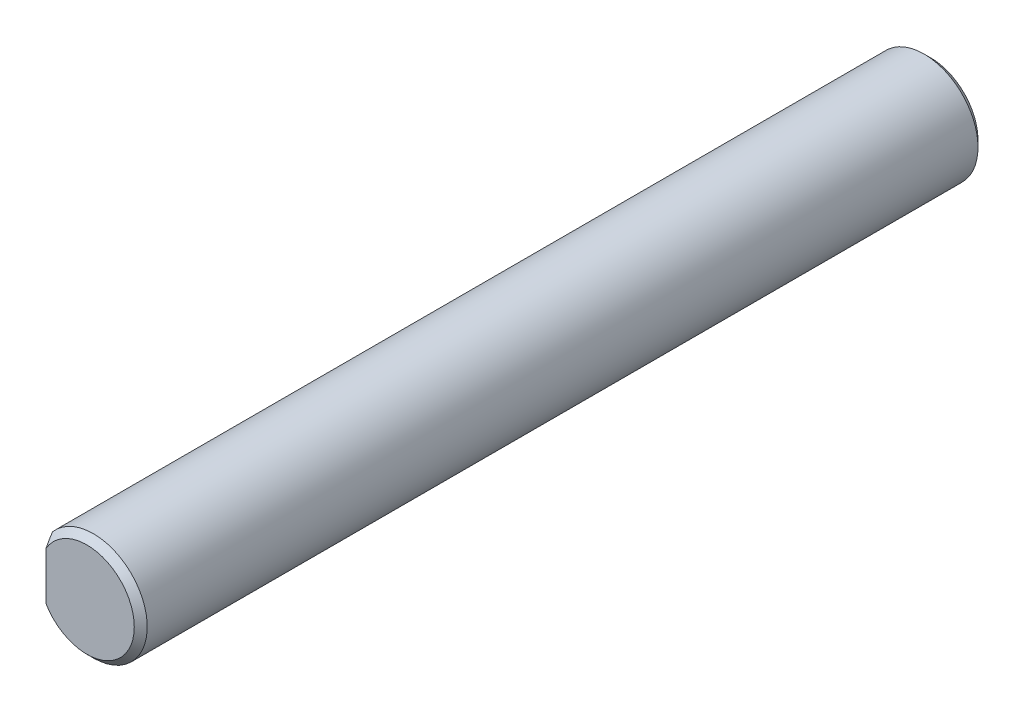
ISO-10303-21;
HEADER;
FILE_DESCRIPTION(('STEP AP214'),'2;1');
FILE_NAME('part.step','',(''),(''),'','','');
FILE_SCHEMA(('AUTOMOTIVE_DESIGN { 1 0 10303 214 1 1 1 1 }'));
ENDSEC;
DATA;
#1=APPLICATION_CONTEXT('core data for automotive mechanical design processes');
#2=APPLICATION_PROTOCOL_DEFINITION('international standard','automotive_design',2000,#1);
#3=PRODUCT_CONTEXT('',#1,'mechanical');
#4=PRODUCT('Part','Part','',(#3));
#5=PRODUCT_RELATED_PRODUCT_CATEGORY('part','',(#4));
#6=PRODUCT_DEFINITION_FORMATION('','',#4);
#7=PRODUCT_DEFINITION_CONTEXT('part definition',#1,'design');
#8=PRODUCT_DEFINITION('design','',#6,#7);
#9=PRODUCT_DEFINITION_SHAPE('','',#8);
#10=(LENGTH_UNIT() NAMED_UNIT(*) SI_UNIT(.MILLI.,.METRE.));
#11=(NAMED_UNIT(*) PLANE_ANGLE_UNIT() SI_UNIT($,.RADIAN.));
#12=(NAMED_UNIT(*) SI_UNIT($,.STERADIAN.) SOLID_ANGLE_UNIT());
#13=UNCERTAINTY_MEASURE_WITH_UNIT(LENGTH_MEASURE(1.E-05),#10,'distance_accuracy_value','');
#14=(GEOMETRIC_REPRESENTATION_CONTEXT(3) GLOBAL_UNCERTAINTY_ASSIGNED_CONTEXT((#13)) GLOBAL_UNIT_ASSIGNED_CONTEXT((#10,
#11,#12)) REPRESENTATION_CONTEXT('',''));
#15=CARTESIAN_POINT('',(0.,0.,0.));
#16=DIRECTION('',(0.,0.,1.));
#17=DIRECTION('',(1.,0.,0.));
#18=AXIS2_PLACEMENT_3D('',#15,#16,#17);
#19=CARTESIAN_POINT('',(0.,0.,65.));
#20=DIRECTION('',(0.,0.,-1.));
#21=DIRECTION('',(-1.,0.,0.));
#22=AXIS2_PLACEMENT_3D('',#19,#20,#21);
#23=CYLINDRICAL_SURFACE('',#22,4.15);
#24=CARTESIAN_POINT('',(0.,0.,64.5));
#25=DIRECTION('',(0.,0.,1.));
#26=DIRECTION('',(1.,0.,0.));
#27=AXIS2_PLACEMENT_3D('',#24,#25,#26);
#28=CIRCLE('',#27,4.15);
#29=CARTESIAN_POINT('',(-3.15,2.70185121722126,64.5));
#30=VERTEX_POINT('',#29);
#31=CARTESIAN_POINT('',(-3.15,-2.70185121722126,64.5));
#32=VERTEX_POINT('',#31);
#33=EDGE_CURVE('E92',#30,#32,#28,.F.);
#34=ORIENTED_EDGE('',*,*,#33,.T.);
#35=DIRECTION('',(0.,0.,-1.));
#36=VECTOR('',#35,1.);
#37=CARTESIAN_POINT('',(-3.15,-2.70185121722126,65.));
#38=LINE('',#37,#36);
#39=CARTESIAN_POINT('',(-3.15,-2.70185121722126,0.5));
#40=VERTEX_POINT('',#39);
#41=EDGE_CURVE('E101',#32,#40,#38,.T.);
#42=ORIENTED_EDGE('',*,*,#41,.T.);
#43=CARTESIAN_POINT('',(0.,0.,0.5));
#44=DIRECTION('',(0.,0.,1.));
#45=DIRECTION('',(1.,0.,0.));
#46=AXIS2_PLACEMENT_3D('',#43,#44,#45);
#47=CIRCLE('',#46,4.15);
#48=CARTESIAN_POINT('',(-3.15,2.70185121722126,0.5));
#49=VERTEX_POINT('',#48);
#50=EDGE_CURVE('E94',#40,#49,#47,.T.);
#51=ORIENTED_EDGE('',*,*,#50,.T.);
#52=DIRECTION('',(0.,0.,-1.));
#53=VECTOR('',#52,1.);
#54=CARTESIAN_POINT('',(-3.15,2.70185121722126,65.));
#55=LINE('',#54,#53);
#56=EDGE_CURVE('E82',#49,#30,#55,.F.);
#57=ORIENTED_EDGE('',*,*,#56,.T.);
#58=EDGE_LOOP('',(#34,#42,#51,#57));
#59=FACE_BOUND('',#58,.T.);
#60=ADVANCED_FACE('F37',(#59),#23,.T.);
#61=CARTESIAN_POINT('',(0.,0.,65.));
#62=DIRECTION('',(0.,0.,1.));
#63=DIRECTION('',(1.,0.,0.));
#64=AXIS2_PLACEMENT_3D('',#61,#62,#63);
#65=PLANE('',#64);
#66=DIRECTION('',(0.,1.,0.));
#67=VECTOR('',#66,1.);
#68=CARTESIAN_POINT('',(-3.15,0.,65.));
#69=LINE('',#68,#67);
#70=CARTESIAN_POINT('',(-3.15,-1.84390889145859,65.));
#71=VERTEX_POINT('',#70);
#72=CARTESIAN_POINT('',(-3.15,1.84390889145859,65.));
#73=VERTEX_POINT('',#72);
#74=EDGE_CURVE('E58',#71,#73,#69,.T.);
#75=ORIENTED_EDGE('',*,*,#74,.F.);
#76=CARTESIAN_POINT('',(0.,0.,65.));
#77=DIRECTION('',(0.,0.,1.));
#78=DIRECTION('',(1.,0.,0.));
#79=AXIS2_PLACEMENT_3D('',#76,#77,#78);
#80=CIRCLE('',#79,3.65000000000001);
#81=EDGE_CURVE('E88',#71,#73,#80,.T.);
#82=ORIENTED_EDGE('',*,*,#81,.T.);
#83=EDGE_LOOP('',(#75,#82));
#84=FACE_BOUND('',#83,.T.);
#85=ADVANCED_FACE('F108',(#84),#65,.T.);
#86=CARTESIAN_POINT('',(0.,0.,0.));
#87=DIRECTION('',(0.,0.,1.));
#88=DIRECTION('',(1.,0.,0.));
#89=AXIS2_PLACEMENT_3D('',#86,#87,#88);
#90=PLANE('',#89);
#91=CARTESIAN_POINT('',(0.,0.,0.));
#92=DIRECTION('',(0.,0.,1.));
#93=DIRECTION('',(1.,0.,0.));
#94=AXIS2_PLACEMENT_3D('',#91,#92,#93);
#95=CIRCLE('',#94,3.65);
#96=CARTESIAN_POINT('',(-3.15,1.84390889145858,0.));
#97=VERTEX_POINT('',#96);
#98=CARTESIAN_POINT('',(-3.15,-1.84390889145858,0.));
#99=VERTEX_POINT('',#98);
#100=EDGE_CURVE('E99',#97,#99,#95,.F.);
#101=ORIENTED_EDGE('',*,*,#100,.T.);
#102=DIRECTION('',(0.,1.,0.));
#103=VECTOR('',#102,1.);
#104=CARTESIAN_POINT('',(-3.15,0.,0.));
#105=LINE('',#104,#103);
#106=EDGE_CURVE('E114',#99,#97,#105,.T.);
#107=ORIENTED_EDGE('',*,*,#106,.T.);
#108=EDGE_LOOP('',(#101,#107));
#109=FACE_BOUND('',#108,.T.);
#110=ADVANCED_FACE('F125',(#109),#90,.F.);
#111=CARTESIAN_POINT('',(0.,0.,0.5));
#112=DIRECTION('',(0.,0.,1.));
#113=DIRECTION('',(1.,0.,0.));
#114=AXIS2_PLACEMENT_3D('',#111,#112,#113);
#115=CONICAL_SURFACE('',#114,4.15,0.785398163397447);
#116=CARTESIAN_POINT('',(-3.15,2.7029262827536,0.500700000000025));
#117=CARTESIAN_POINT('',(-3.15,2.637629899807,0.458184375078678));
#118=CARTESIAN_POINT('',(-3.15,2.57193326148151,0.416284388262859));
#119=CARTESIAN_POINT('',(-3.15,2.43962651077146,0.333916313916338));
#120=CARTESIAN_POINT('',(-3.15,2.37301617336793,0.29344858822739));
#121=CARTESIAN_POINT('',(-3.15,2.17105563797646,0.174149128258098));
#122=CARTESIAN_POINT('',(-3.15,2.03419581282266,0.0978300599651566));
#123=CARTESIAN_POINT('',(-3.15,1.75198989868226,-0.0476469780505971));
#124=CARTESIAN_POINT('',(-3.15,1.60651457541972,-0.116557220023333));
#125=CARTESIAN_POINT('',(-3.15,1.31013625517199,-0.241047530711626));
#126=CARTESIAN_POINT('',(-3.15,1.15924472299722,-0.296654043996579));
#127=CARTESIAN_POINT('',(-3.15,0.912569641399158,-0.371673187384497));
#128=CARTESIAN_POINT('',(-3.15,0.818498691645566,-0.396713913770698));
#129=CARTESIAN_POINT('',(-3.15,0.628627521630974,-0.43921815059806));
#130=CARTESIAN_POINT('',(-3.15,0.532827259030031,-0.45668147525373));
#131=CARTESIAN_POINT('',(-3.15,0.341148384622092,-0.482985820588795));
#132=CARTESIAN_POINT('',(-3.15,0.245283147879756,-0.491922981085286));
#133=CARTESIAN_POINT('',(-3.15,0.0531360260590637,-0.501013201032776));
#134=CARTESIAN_POINT('',(-3.15,-0.0431458299271616,-0.501166864234979));
#135=CARTESIAN_POINT('',(-3.15,-0.235354750454422,-0.492680380767895));
#136=CARTESIAN_POINT('',(-3.15,-0.33128165034413,-0.484036567842685));
#137=CARTESIAN_POINT('',(-3.15,-0.522013041428308,-0.458439399235446));
#138=CARTESIAN_POINT('',(-3.15,-0.616817404154601,-0.441485101700384));
#139=CARTESIAN_POINT('',(-3.15,-0.805812939144923,-0.399886881205596));
#140=CARTESIAN_POINT('',(-3.15,-0.899985422854078,-0.375159152178022));
#141=CARTESIAN_POINT('',(-3.15,-1.08632599779303,-0.319128693978767));
#142=CARTESIAN_POINT('',(-3.15,-1.17849408684547,-0.287825957665118));
#143=CARTESIAN_POINT('',(-3.15,-1.39793109253278,-0.205796928834585));
#144=CARTESIAN_POINT('',(-3.15,-1.52418124018571,-0.152356182736309));
#145=CARTESIAN_POINT('',(-3.15,-1.77284373915982,-0.0370620082297331));
#146=CARTESIAN_POINT('',(-3.15,-1.89525251939717,0.0247989785893932));
#147=CARTESIAN_POINT('',(-3.15,-2.13354971021547,0.153251610695179));
#148=CARTESIAN_POINT('',(-3.15,-2.24952473951393,0.219683828197564));
#149=CARTESIAN_POINT('',(-3.15,-2.42122613948456,0.322751459823801));
#150=CARTESIAN_POINT('',(-3.15,-2.47801776157065,0.357634291878479));
#151=CARTESIAN_POINT('',(-3.15,-2.59094623976219,0.428427545954595));
#152=CARTESIAN_POINT('',(-3.15,-2.6470831870412,0.464337822423802));
#153=CARTESIAN_POINT('',(-3.15,-2.7029262827536,0.500700000000026));
#154=B_SPLINE_CURVE_WITH_KNOTS('',3,(#116,#117,#118,#119,#120,#121,#122,#123,#124,#125,#126,
#127,#128,#129,#130,#131,#132,#133,#134,#135,#136,#137,#138,#139,#140,#141,#142,#143,#144,#145,
#146,#147,#148,#149,#150,#151,#152,#153),.UNSPECIFIED.,.F.,.F.,(4,2,2,2,2,2,2,2,2,2,2,2,2,2,2,2,
2,2,4),(0.,0.233746454261257,0.467551545949215,0.937387559992727,1.41985669791922,
1.90135868506937,2.19313872315265,2.48492591480079,2.7733826491856,3.06181955589766,
3.35037671490418,3.63896658455378,3.93078112099976,4.222595974425,4.63345118845378,
5.04467766830278,5.44549250636035,5.6454312442884,5.84534179691798),.UNSPECIFIED.);
#155=EDGE_CURVE('E95',#49,#97,#154,.T.);
#156=ORIENTED_EDGE('',*,*,#155,.F.);
#157=ORIENTED_EDGE('',*,*,#50,.F.);
#158=EDGE_CURVE('E65',#99,#40,#154,.T.);
#159=ORIENTED_EDGE('',*,*,#158,.F.);
#160=ORIENTED_EDGE('',*,*,#100,.F.);
#161=EDGE_LOOP('',(#156,#157,#159,#160));
#162=FACE_BOUND('',#161,.T.);
#163=ADVANCED_FACE('F116',(#162),#115,.T.);
#164=CARTESIAN_POINT('',(0.,0.,65.));
#165=DIRECTION('',(0.,0.,-1.));
#166=DIRECTION('',(-1.,0.,0.));
#167=AXIS2_PLACEMENT_3D('',#164,#165,#166);
#168=CONICAL_SURFACE('',#167,3.65000000000001,0.785398163397441);
#169=CARTESIAN_POINT('',(-3.15,-2.70292628275361,64.4993));
#170=CARTESIAN_POINT('',(-3.15,-2.63762989980701,64.5418156249213));
#171=CARTESIAN_POINT('',(-3.15,-2.57193326148152,64.5837156117371));
#172=CARTESIAN_POINT('',(-3.15,-2.43962651077148,64.6660836860837));
#173=CARTESIAN_POINT('',(-3.15,-2.37301617336794,64.7065514117726));
#174=CARTESIAN_POINT('',(-3.15,-2.17105563797648,64.8258508717419));
#175=CARTESIAN_POINT('',(-3.15,-2.03419581282267,64.9021699400349));
#176=CARTESIAN_POINT('',(-3.15,-1.75198989868228,65.0476469780506));
#177=CARTESIAN_POINT('',(-3.15,-1.60651457541974,65.1165572200233));
#178=CARTESIAN_POINT('',(-3.15,-1.31013625517201,65.2410475307116));
#179=CARTESIAN_POINT('',(-3.15,-1.15924472299724,65.2966540439966));
#180=CARTESIAN_POINT('',(-3.15,-0.912569641399176,65.3716731873845));
#181=CARTESIAN_POINT('',(-3.15,-0.818498691645585,65.3967139137707));
#182=CARTESIAN_POINT('',(-3.15,-0.628627521630995,65.4392181505981));
#183=CARTESIAN_POINT('',(-3.15,-0.532827259030053,65.4566814752537));
#184=CARTESIAN_POINT('',(-3.15,-0.341148384622116,65.4829858205888));
#185=CARTESIAN_POINT('',(-3.15,-0.245283147879782,65.4919229810853));
#186=CARTESIAN_POINT('',(-3.15,-0.0531360260590921,65.5010132010328));
#187=CARTESIAN_POINT('',(-3.15,0.0431458299271322,65.501166864235));
#188=CARTESIAN_POINT('',(-3.15,0.235354750454389,65.4926803807679));
#189=CARTESIAN_POINT('',(-3.15,0.331281650344096,65.4840365678427));
#190=CARTESIAN_POINT('',(-3.15,0.522013041428272,65.4584393992355));
#191=CARTESIAN_POINT('',(-3.15,0.616817404154564,65.4414851017004));
#192=CARTESIAN_POINT('',(-3.15,0.805812939144883,65.3998868812056));
#193=CARTESIAN_POINT('',(-3.15,0.899985422854036,65.3751591521781));
#194=CARTESIAN_POINT('',(-3.15,1.08632599779298,65.3191286939788));
#195=CARTESIAN_POINT('',(-3.15,1.17849408684543,65.2878259576651));
#196=CARTESIAN_POINT('',(-3.15,1.39793109253275,65.2057969288346));
#197=CARTESIAN_POINT('',(-3.15,1.52418124018568,65.1523561827363));
#198=CARTESIAN_POINT('',(-3.15,1.7728437391598,65.0370620082297));
#199=CARTESIAN_POINT('',(-3.15,1.89525251939715,64.9752010214106));
#200=CARTESIAN_POINT('',(-3.15,2.13354971021546,64.8467483893048));
#201=CARTESIAN_POINT('',(-3.15,2.24952473951393,64.7803161718025));
#202=CARTESIAN_POINT('',(-3.15,2.42122613948456,64.6772485401762));
#203=CARTESIAN_POINT('',(-3.15,2.47801776157066,64.6423657081215));
#204=CARTESIAN_POINT('',(-3.15,2.5909462397622,64.5715724540454));
#205=CARTESIAN_POINT('',(-3.15,2.6470831870412,64.5356621775762));
#206=CARTESIAN_POINT('',(-3.15,2.70292628275361,64.4993));
#207=B_SPLINE_CURVE_WITH_KNOTS('',3,(#169,#170,#171,#172,#173,#174,#175,#176,#177,#178,#179,
#180,#181,#182,#183,#184,#185,#186,#187,#188,#189,#190,#191,#192,#193,#194,#195,#196,#197,#198,
#199,#200,#201,#202,#203,#204,#205,#206),.UNSPECIFIED.,.F.,.F.,(4,2,2,2,2,2,2,2,2,2,2,2,2,2,2,2,
2,2,4),(0.,0.233746454261255,0.467551545949215,0.937387559992728,1.41985669791921,
1.90135868506938,2.19313872315265,2.48492591480078,2.77338264918559,3.06181955589765,
3.35037671490417,3.63896658455376,3.93078112099973,4.22259597442497,4.63345118845378,
5.0446776683028,5.44549250636038,5.64543124428844,5.84534179691802),.UNSPECIFIED.);
#208=EDGE_CURVE('E11',#32,#71,#207,.T.);
#209=ORIENTED_EDGE('',*,*,#208,.F.);
#210=ORIENTED_EDGE('',*,*,#33,.F.);
#211=EDGE_CURVE('E43',#73,#30,#207,.T.);
#212=ORIENTED_EDGE('',*,*,#211,.F.);
#213=ORIENTED_EDGE('',*,*,#81,.F.);
#214=EDGE_LOOP('',(#209,#210,#212,#213));
#215=FACE_BOUND('',#214,.T.);
#216=ADVANCED_FACE('F40',(#215),#168,.T.);
#217=CARTESIAN_POINT('',(-3.15,-3.81962003953678,-0.5));
#218=DIRECTION('',(1.,0.,0.));
#219=DIRECTION('',(0.,1.,0.));
#220=AXIS2_PLACEMENT_3D('',#217,#218,#219);
#221=PLANE('',#220);
#222=ORIENTED_EDGE('',*,*,#158,.T.);
#223=ORIENTED_EDGE('',*,*,#41,.F.);
#224=ORIENTED_EDGE('',*,*,#208,.T.);
#225=ORIENTED_EDGE('',*,*,#74,.T.);
#226=ORIENTED_EDGE('',*,*,#211,.T.);
#227=ORIENTED_EDGE('',*,*,#56,.F.);
#228=ORIENTED_EDGE('',*,*,#155,.T.);
#229=ORIENTED_EDGE('',*,*,#106,.F.);
#230=EDGE_LOOP('',(#222,#223,#224,#225,#226,#227,#228,#229));
#231=FACE_BOUND('',#230,.T.);
#232=ADVANCED_FACE('F81',(#231),#221,.F.);
#233=CLOSED_SHELL('',(#60,#85,#110,#163,#216,#232));
#234=MANIFOLD_SOLID_BREP('B2',#233);
#235=ADVANCED_BREP_SHAPE_REPRESENTATION('',(#18,#234),#14);
#236=SHAPE_DEFINITION_REPRESENTATION(#9,#235);
ENDSEC;
END-ISO-10303-21;
